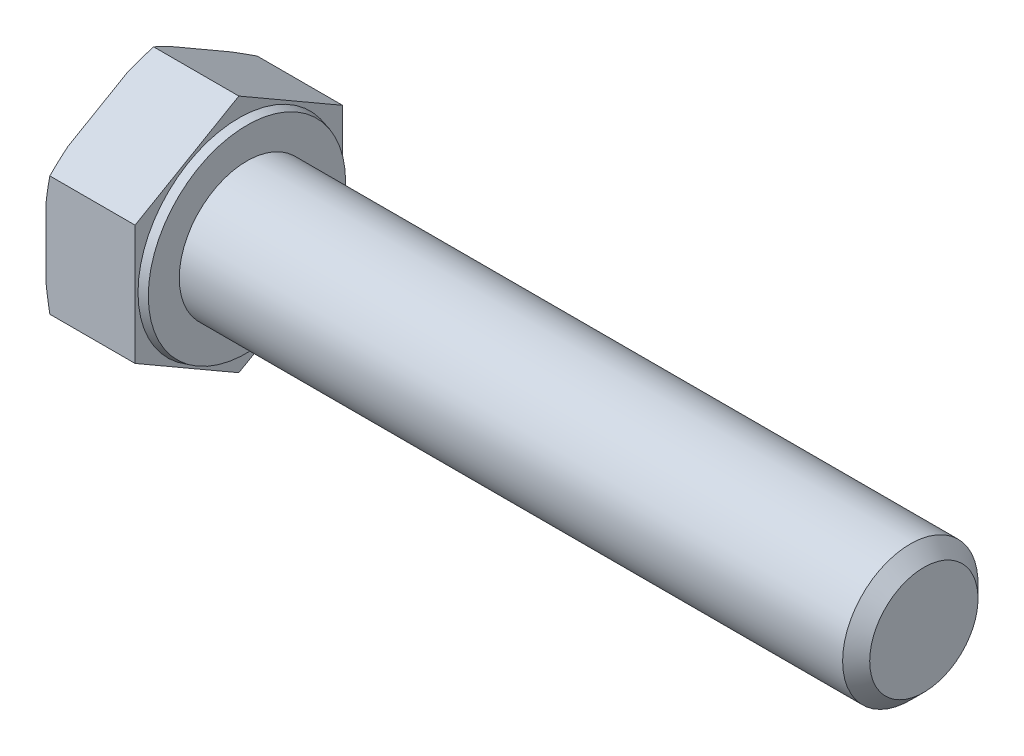
ISO-10303-21;
HEADER;
FILE_DESCRIPTION(('STEP AP214'),'2;1');
FILE_NAME('part.step','',(''),(''),'','','');
FILE_SCHEMA(('AUTOMOTIVE_DESIGN { 1 0 10303 214 1 1 1 1 }'));
ENDSEC;
DATA;
#1=APPLICATION_CONTEXT('core data for automotive mechanical design processes');
#2=APPLICATION_PROTOCOL_DEFINITION('international standard','automotive_design',2000,#1);
#3=PRODUCT_CONTEXT('',#1,'mechanical');
#4=PRODUCT('Part','Part','',(#3));
#5=PRODUCT_RELATED_PRODUCT_CATEGORY('part','',(#4));
#6=PRODUCT_DEFINITION_FORMATION('','',#4);
#7=PRODUCT_DEFINITION_CONTEXT('part definition',#1,'design');
#8=PRODUCT_DEFINITION('design','',#6,#7);
#9=PRODUCT_DEFINITION_SHAPE('','',#8);
#10=(LENGTH_UNIT() NAMED_UNIT(*) SI_UNIT(.MILLI.,.METRE.));
#11=(NAMED_UNIT(*) PLANE_ANGLE_UNIT() SI_UNIT($,.RADIAN.));
#12=(NAMED_UNIT(*) SI_UNIT($,.STERADIAN.) SOLID_ANGLE_UNIT());
#13=UNCERTAINTY_MEASURE_WITH_UNIT(LENGTH_MEASURE(1.E-05),#10,'distance_accuracy_value','');
#14=(GEOMETRIC_REPRESENTATION_CONTEXT(3) GLOBAL_UNCERTAINTY_ASSIGNED_CONTEXT((#13)) GLOBAL_UNIT_ASSIGNED_CONTEXT((#10,
#11,#12)) REPRESENTATION_CONTEXT('',''));
#15=CARTESIAN_POINT('',(0.,0.,0.));
#16=DIRECTION('',(0.,0.,1.));
#17=DIRECTION('',(1.,0.,0.));
#18=AXIS2_PLACEMENT_3D('',#15,#16,#17);
#19=CARTESIAN_POINT('',(50.6,-4.42500000000009,-7.66432482349223));
#20=DIRECTION('',(0.,-0.866025403784442,-0.499999999999995));
#21=DIRECTION('',(0.,0.499999999999995,-0.866025403784441));
#22=AXIS2_PLACEMENT_3D('',#19,#20,#21);
#23=PLANE('',#22);
#24=DIRECTION('',(-1.,0.,0.));
#25=VECTOR('',#24,1.);
#26=CARTESIAN_POINT('',(50.6,-8.85,0.));
#27=LINE('',#26,#25);
#28=CARTESIAN_POINT('',(0.,-8.85,0.));
#29=VERTEX_POINT('',#28);
#30=CARTESIAN_POINT('',(-6.29792306844368,-8.85,0.));
#31=VERTEX_POINT('',#30);
#32=EDGE_CURVE('E158',#29,#31,#27,.T.);
#33=ORIENTED_EDGE('',*,*,#32,.T.);
#34=CARTESIAN_POINT('',(-4.7699615006699,-11.9174022332107,5.3128965151713));
#35=CARTESIAN_POINT('',(-4.83614833570257,-11.8050473190038,5.11829209528478));
#36=CARTESIAN_POINT('',(-4.90167255003095,-11.6925948603644,4.92351872348535));
#37=CARTESIAN_POINT('',(-5.03118559698242,-11.4674663528304,4.53358471020429));
#38=CARTESIAN_POINT('',(-5.09517439305191,-11.3547902986816,4.33842405962226));
#39=CARTESIAN_POINT('',(-5.28456041407138,-11.0163157536771,3.75216895060564));
#40=CARTESIAN_POINT('',(-5.40733223857273,-10.7901468045143,3.3604328395613));
#41=CARTESIAN_POINT('',(-5.64480594732521,-10.3342684187143,2.57082831328319));
#42=CARTESIAN_POINT('',(-5.75941225873481,-10.1045464495324,2.17293819104533));
#43=CARTESIAN_POINT('',(-5.97591685440881,-9.6436033227612,1.37456127607789));
#44=CARTESIAN_POINT('',(-6.07781581130404,-9.41238224520544,0.974074621970503));
#45=CARTESIAN_POINT('',(-6.26134144326315,-8.95638364479248,0.184261877874949));
#46=CARTESIAN_POINT('',(-6.34355573274743,-8.73166601658844,-0.204960471530831));
#47=CARTESIAN_POINT('',(-6.48746045966098,-8.2805512783751,-0.986314118159494));
#48=CARTESIAN_POINT('',(-6.54915189984519,-8.05415425097466,-1.37844527229961));
#49=CARTESIAN_POINT('',(-6.62254434564547,-7.71410474496151,-1.9674282938031));
#50=CARTESIAN_POINT('',(-6.64378861584913,-7.60095958105454,-2.16340146632069));
#51=CARTESIAN_POINT('',(-6.67950592063896,-7.37440457175731,-2.55580625313272));
#52=CARTESIAN_POINT('',(-6.69397933196105,-7.26099474144627,-2.75223784130922));
#53=CARTESIAN_POINT('',(-6.7157765759338,-7.03401139991638,-3.14538452131075));
#54=CARTESIAN_POINT('',(-6.72310096885371,-6.92043790222291,-3.34209958970915));
#55=CARTESIAN_POINT('',(-6.73040192529392,-6.69323186195545,-3.73563199523894));
#56=CARTESIAN_POINT('',(-6.73037853713207,-6.57959931977464,-3.93244933168932));
#57=CARTESIAN_POINT('',(-6.72320871548941,-6.35929562962563,-4.31402651612232));
#58=CARTESIAN_POINT('',(-6.71649505277964,-6.25262090601261,-4.49879255730344));
#59=CARTESIAN_POINT('',(-6.69675463432834,-6.03941600442701,-4.86807427927243));
#60=CARTESIAN_POINT('',(-6.68372760236287,-5.93288583298343,-5.05258994875172));
#61=CARTESIAN_POINT('',(-6.63559663675346,-5.61363013252953,-5.60555704254388));
#62=CARTESIAN_POINT('',(-6.59144268713134,-5.40123548697151,-5.97343535990596));
#63=CARTESIAN_POINT('',(-6.48226269320506,-4.97681311893132,-6.70855646522027));
#64=CARTESIAN_POINT('',(-6.41713860156276,-4.7647919199632,-7.07578795411474));
#65=CARTESIAN_POINT('',(-6.27018625376656,-4.34222339340586,-7.80769811179158));
#66=CARTESIAN_POINT('',(-6.18835790112246,-4.1316760743376,-8.17237676581522));
#67=CARTESIAN_POINT('',(-6.00866271800198,-3.70472589760515,-8.91187616421634));
#68=CARTESIAN_POINT('',(-5.91033992742069,-3.48837165185492,-9.286612710289));
#69=CARTESIAN_POINT('',(-5.70311989656312,-3.05693413716248,-10.0338844060276));
#70=CARTESIAN_POINT('',(-5.59422212603359,-2.84185093252738,-10.4064194443103));
#71=CARTESIAN_POINT('',(-5.36943684134144,-2.41473283183158,-11.1462096955477));
#72=CARTESIAN_POINT('',(-5.25362330968472,-2.2026881429877,-11.5134818701005));
#73=CARTESIAN_POINT('',(-5.07537550670142,-1.88529185166037,-12.0632283728134));
#74=CARTESIAN_POINT('',(-5.01521325258259,-1.77961882394802,-12.2462594258008));
#75=CARTESIAN_POINT('',(-4.89354912869936,-1.56846779942573,-12.6119837283436));
#76=CARTESIAN_POINT('',(-4.83204728425027,-1.462989798971,-12.794676984212));
#77=CARTESIAN_POINT('',(-4.7699615006699,-1.35759776678936,-12.9772213386635));
#78=B_SPLINE_CURVE_WITH_KNOTS('',3,(#34,#35,#36,#37,#38,#39,#40,#41,#42,#43,#44,#45,#46,#47,#48,
#49,#50,#51,#52,#53,#54,#55,#56,#57,#58,#59,#60,#61,#62,#63,#64,#65,#66,#67,#68,#69,#70,#71,#72,
#73,#74,#75,#76,#77),.UNSPECIFIED.,.F.,.F.,(4,2,2,2,2,2,2,2,2,2,2,2,2,2,2,2,2,2,2,2,2,4),(0.,
0.70276173034238,1.40554017472233,2.81157217612387,4.23201032618944,5.6523732571052,
7.02270828812482,8.39297635416766,9.07474696516834,9.75647963740092,10.438158877887,
11.119833635759,11.7601005309412,12.4003954417532,13.6809617128842,14.9676044823533,
16.2542546841745,17.5852978857349,18.9164078632869,20.2352036230902,20.894426976119,
21.553637882061),.UNSPECIFIED.);
#79=CARTESIAN_POINT('',(-6.58000000000003,-7.90869530364146,-1.63038755949604));
#80=VERTEX_POINT('',#79);
#81=EDGE_CURVE('E203',#31,#80,#78,.T.);
#82=ORIENTED_EDGE('',*,*,#81,.T.);
#83=DIRECTION('',(0.,-0.499999999999995,0.866025403784442));
#84=VECTOR('',#83,1.);
#85=CARTESIAN_POINT('',(-6.58,-4.42500000000009,-7.66432482349223));
#86=LINE('',#85,#84);
#87=CARTESIAN_POINT('',(-6.58,-5.36630469635854,-6.03393726399618));
#88=VERTEX_POINT('',#87);
#89=EDGE_CURVE('E213',#88,#80,#86,.T.);
#90=ORIENTED_EDGE('',*,*,#89,.F.);
#91=CARTESIAN_POINT('',(-6.29792306844368,-4.42500000000009,-7.66432482349223));
#92=VERTEX_POINT('',#91);
#93=EDGE_CURVE('E216',#88,#92,#78,.T.);
#94=ORIENTED_EDGE('',*,*,#93,.T.);
#95=DIRECTION('',(-1.,0.,0.));
#96=VECTOR('',#95,1.);
#97=CARTESIAN_POINT('',(50.6,-4.42500000000009,-7.66432482349223));
#98=LINE('',#97,#96);
#99=CARTESIAN_POINT('',(0.,-4.42500000000009,-7.66432482349223));
#100=VERTEX_POINT('',#99);
#101=EDGE_CURVE('E169',#100,#92,#98,.T.);
#102=ORIENTED_EDGE('',*,*,#101,.F.);
#103=DIRECTION('',(0.,-0.499999999999995,0.866025403784441));
#104=VECTOR('',#103,1.);
#105=CARTESIAN_POINT('',(0.,-4.42500000000009,-7.66432482349223));
#106=LINE('',#105,#104);
#107=EDGE_CURVE('E184',#100,#29,#106,.T.);
#108=ORIENTED_EDGE('',*,*,#107,.T.);
#109=EDGE_LOOP('',(#33,#82,#90,#94,#102,#108));
#110=FACE_BOUND('',#109,.T.);
#111=ADVANCED_FACE('F36',(#110),#23,.T.);
#112=CARTESIAN_POINT('',(50.6,4.42499999999993,-7.66432482349232));
#113=DIRECTION('',(0.,0.,-1.));
#114=DIRECTION('',(0.,1.,0.));
#115=AXIS2_PLACEMENT_3D('',#112,#113,#114);
#116=PLANE('',#115);
#117=ORIENTED_EDGE('',*,*,#101,.T.);
#118=CARTESIAN_POINT('',(-5.00864005639831,-9.73789651517145,-7.66432482349217));
#119=CARTESIAN_POINT('',(-5.07003318744064,-9.52322769233334,-7.66432482349218));
#120=CARTESIAN_POINT('',(-5.13071664914256,-9.30835600664128,-7.66432482349218));
#121=CARTESIAN_POINT('',(-5.2504442425723,-8.87815277711283,-7.66432482349218));
#122=CARTESIAN_POINT('',(-5.30948834652955,-8.66282122555281,-7.66432482349219));
#123=CARTESIAN_POINT('',(-5.48387527888684,-8.01589307910885,-7.66432482349219));
#124=CARTESIAN_POINT('',(-5.59642298983084,-7.58353558067021,-7.6643248234922));
#125=CARTESIAN_POINT('',(-5.81266226723173,-6.71259000391773,-7.66432482349221));
#126=CARTESIAN_POINT('',(-5.91626806915323,-6.27398046842187,-7.66432482349221));
#127=CARTESIAN_POINT('',(-6.11029091280608,-5.39384656433909,-7.66432482349222));
#128=CARTESIAN_POINT('',(-6.20070892550878,-4.95232241284974,-7.66432482349222));
#129=CARTESIAN_POINT('',(-6.36160933963008,-4.08051166755351,-7.66432482349223));
#130=CARTESIAN_POINT('',(-6.43264625776086,-3.65032885049375,-7.66432482349224));
#131=CARTESIAN_POINT('',(-6.55428187483288,-2.78707107422335,-7.66432482349225));
#132=CARTESIAN_POINT('',(-6.60488453148917,-2.35399669158535,-7.66432482349225));
#133=CARTESIAN_POINT('',(-6.66240831794471,-1.70368188145931,-7.66432482349226));
#134=CARTESIAN_POINT('',(-6.67850532779577,-1.48723464984804,-7.66432482349226));
#135=CARTESIAN_POINT('',(-6.70429433272965,-1.05396299728827,-7.66432482349227));
#136=CARTESIAN_POINT('',(-6.71398664875919,-0.837138595786226,-7.66432482349227));
#137=CARTESIAN_POINT('',(-6.72672253024382,-0.403302294793051,-7.66432482349227));
#138=CARTESIAN_POINT('',(-6.72976638437883,-0.186290403852155,-7.66432482349227));
#139=CARTESIAN_POINT('',(-6.7291358967764,0.247718950123678,-7.66432482349228));
#140=CARTESIAN_POINT('',(-6.72546155695146,0.464716413162706,-7.66432482349228));
#141=CARTESIAN_POINT('',(-6.70624362970486,1.06036953223341,-7.66432482349229));
#142=CARTESIAN_POINT('',(-6.68388895075078,1.43882252598365,-7.66432482349229));
#143=CARTESIAN_POINT('',(-6.62050559151052,2.19412494594648,-7.6643248234923));
#144=CARTESIAN_POINT('',(-6.57947609181733,2.57097430106276,-7.6643248234923));
#145=CARTESIAN_POINT('',(-6.48113797206862,3.32388976987407,-7.66432482349231));
#146=CARTESIAN_POINT('',(-6.4237712185853,3.69994816672772,-7.66432482349232));
#147=CARTESIAN_POINT('',(-6.2956564145037,4.44978573942378,-7.66432482349232));
#148=CARTESIAN_POINT('',(-6.22490691200718,4.82356466341955,-7.66432482349233));
#149=CARTESIAN_POINT('',(-6.0704014797458,5.58003633732887,-7.66432482349234));
#150=CARTESIAN_POINT('',(-5.98632024183774,5.96266195818458,-7.66432482349234));
#151=CARTESIAN_POINT('',(-5.80919867667365,6.72583533235177,-7.66432482349235));
#152=CARTESIAN_POINT('',(-5.71615790531566,7.10638298167437,-7.66432482349235));
#153=CARTESIAN_POINT('',(-5.52374117974904,7.86297645537245,-7.66432482349236));
#154=CARTESIAN_POINT('',(-5.42441511026811,8.23903503370974,-7.66432482349236));
#155=CARTESIAN_POINT('',(-5.27134102225385,8.80195695976291,-7.66432482349237));
#156=CARTESIAN_POINT('',(-5.21964171692946,8.98938164843282,-7.66432482349237));
#157=CARTESIAN_POINT('',(-5.11502150400523,9.36388780999383,-7.66432482349237));
#158=CARTESIAN_POINT('',(-5.06210060924165,9.55096928646908,-7.66432482349238));
#159=CARTESIAN_POINT('',(-5.00864005639831,9.73789651517129,-7.66432482349238));
#160=B_SPLINE_CURVE_WITH_KNOTS('',3,(#118,#119,#120,#121,#122,#123,#124,#125,#126,#127,#128,
#129,#130,#131,#132,#133,#134,#135,#136,#137,#138,#139,#140,#141,#142,#143,#144,#145,#146,#147,
#148,#149,#150,#151,#152,#153,#154,#155,#156,#157,#158,#159),.UNSPECIFIED.,.F.,.F.,(4,2,2,2,2,2,
2,2,2,2,2,2,2,2,2,2,2,2,2,2,4),(0.,0.669823290546161,1.33965792092904,2.67986595636369,
4.03175825312792,5.38355096443301,6.69120700403605,7.99860965473741,8.64966414612008,
9.300686009923,9.95167960543101,10.6026730156168,11.7394565125237,12.876289893615,
14.0172201663474,15.1582742899967,16.3334026116279,17.5085892114817,18.6753990362947,
19.2586689197893,19.8419326771629),.UNSPECIFIED.);
#161=CARTESIAN_POINT('',(-6.58000000000003,-2.54239060728318,-7.66432482349217));
#162=VERTEX_POINT('',#161);
#163=EDGE_CURVE('E224',#92,#162,#160,.T.);
#164=ORIENTED_EDGE('',*,*,#163,.T.);
#165=DIRECTION('',(0.,-1.,0.));
#166=VECTOR('',#165,1.);
#167=CARTESIAN_POINT('',(-6.58,4.42499999999993,-7.66432482349232));
#168=LINE('',#167,#166);
#169=CARTESIAN_POINT('',(-6.58,2.54239060728305,-7.6643248234923));
#170=VERTEX_POINT('',#169);
#171=EDGE_CURVE('E164',#170,#162,#168,.T.);
#172=ORIENTED_EDGE('',*,*,#171,.F.);
#173=CARTESIAN_POINT('',(-6.29792306844368,4.42499999999993,-7.66432482349232));
#174=VERTEX_POINT('',#173);
#175=EDGE_CURVE('E51',#170,#174,#160,.T.);
#176=ORIENTED_EDGE('',*,*,#175,.T.);
#177=DIRECTION('',(-1.,0.,0.));
#178=VECTOR('',#177,1.);
#179=CARTESIAN_POINT('',(50.6,4.42499999999993,-7.66432482349232));
#180=LINE('',#179,#178);
#181=CARTESIAN_POINT('',(0.,4.42499999999993,-7.66432482349232));
#182=VERTEX_POINT('',#181);
#183=EDGE_CURVE('E155',#182,#174,#180,.T.);
#184=ORIENTED_EDGE('',*,*,#183,.F.);
#185=DIRECTION('',(0.,-1.,0.));
#186=VECTOR('',#185,1.);
#187=CARTESIAN_POINT('',(0.,8.84999999999992,-7.66432482349237));
#188=LINE('',#187,#186);
#189=EDGE_CURVE('E182',#182,#100,#188,.T.);
#190=ORIENTED_EDGE('',*,*,#189,.T.);
#191=EDGE_LOOP('',(#117,#164,#172,#176,#184,#190));
#192=FACE_BOUND('',#191,.T.);
#193=ADVANCED_FACE('F251',(#192),#116,.T.);
#194=CARTESIAN_POINT('',(50.6,8.85,0.));
#195=DIRECTION('',(0.,0.866025403784435,-0.500000000000007));
#196=DIRECTION('',(0.,0.500000000000007,0.866025403784435));
#197=AXIS2_PLACEMENT_3D('',#194,#195,#196);
#198=PLANE('',#197);
#199=ORIENTED_EDGE('',*,*,#183,.T.);
#200=CARTESIAN_POINT('',(-4.76996150066986,1.35759776678906,-12.9772213386637));
#201=CARTESIAN_POINT('',(-4.83614833570253,1.46995268099604,-12.7826169187772));
#202=CARTESIAN_POINT('',(-4.9016725500309,1.58240513963541,-12.5878435469777));
#203=CARTESIAN_POINT('',(-5.03118559698238,1.80753364716942,-12.1979095336967));
#204=CARTESIAN_POINT('',(-5.09517439305187,1.92020970131818,-12.0027488831146));
#205=CARTESIAN_POINT('',(-5.28456041407135,2.25868424632273,-11.416493774098));
#206=CARTESIAN_POINT('',(-5.40733223857269,2.48485319548548,-11.0247576630537));
#207=CARTESIAN_POINT('',(-5.64480594732517,2.94073158128551,-10.2351531367756));
#208=CARTESIAN_POINT('',(-5.75941225873478,3.17045355046743,-9.83726301453771));
#209=CARTESIAN_POINT('',(-5.97591685440879,3.63139667723867,-9.03888609957028));
#210=CARTESIAN_POINT('',(-6.07781581130402,3.86261775479443,-8.63839944546289));
#211=CARTESIAN_POINT('',(-6.26134144326313,4.3186163552074,-7.84858670136733));
#212=CARTESIAN_POINT('',(-6.34355573274742,4.54333398341145,-7.45936435196155));
#213=CARTESIAN_POINT('',(-6.48746045966097,4.99444872162482,-6.67801070533289));
#214=CARTESIAN_POINT('',(-6.54915189984519,5.22084574902526,-6.28587955119277));
#215=CARTESIAN_POINT('',(-6.62254434564547,5.56089525503842,-5.69689652968929));
#216=CARTESIAN_POINT('',(-6.64378861584913,5.6740404189454,-5.5009233571717));
#217=CARTESIAN_POINT('',(-6.67950592063896,5.90059542824263,-5.10851857035966));
#218=CARTESIAN_POINT('',(-6.69397933196106,6.01400525855368,-4.91208698218316));
#219=CARTESIAN_POINT('',(-6.7157765759338,6.24098860008357,-4.51894030218163));
#220=CARTESIAN_POINT('',(-6.72310096885372,6.35456209777704,-4.32222523378324));
#221=CARTESIAN_POINT('',(-6.73040192529394,6.58176813804451,-3.92869282825345));
#222=CARTESIAN_POINT('',(-6.73037853713208,6.69540068022533,-3.73187549180306));
#223=CARTESIAN_POINT('',(-6.72320871548943,6.91570437037435,-3.35029830737006));
#224=CARTESIAN_POINT('',(-6.71649505277966,7.02237909398738,-3.16553226618893));
#225=CARTESIAN_POINT('',(-6.69675463432836,7.23558399557298,-2.79625054421994));
#226=CARTESIAN_POINT('',(-6.68372760236289,7.34211416701656,-2.61173487474064));
#227=CARTESIAN_POINT('',(-6.63559663675348,7.66136986747048,-2.05876778094847));
#228=CARTESIAN_POINT('',(-6.59144268713136,7.87376451302852,-1.69088946358639));
#229=CARTESIAN_POINT('',(-6.48226269320508,8.29818688106872,-0.955768358272066));
#230=CARTESIAN_POINT('',(-6.41713860156277,8.51020808003686,-0.588536869377594));
#231=CARTESIAN_POINT('',(-6.27018625376657,8.93277660659422,0.143373288299261));
#232=CARTESIAN_POINT('',(-6.18835790112246,9.14332392566248,0.508051942322905));
#233=CARTESIAN_POINT('',(-6.00866271800198,9.57027410239495,1.24755134072404));
#234=CARTESIAN_POINT('',(-5.91033992742068,9.7866283481452,1.62228788679671));
#235=CARTESIAN_POINT('',(-5.7031198965631,10.2180658628377,2.36955958253527));
#236=CARTESIAN_POINT('',(-5.59422212603357,10.4331490674728,2.74209462081801));
#237=CARTESIAN_POINT('',(-5.36943684134141,10.8602671681686,3.48188487205548));
#238=CARTESIAN_POINT('',(-5.25362330968469,11.0723118570125,3.84915704660822));
#239=CARTESIAN_POINT('',(-5.07537550670138,11.3897081483398,4.39890354932111));
#240=CARTESIAN_POINT('',(-5.01521325258256,11.4953811760522,4.58193460230855));
#241=CARTESIAN_POINT('',(-4.89354912869932,11.7065322005745,4.94765890485139));
#242=CARTESIAN_POINT('',(-4.83204728425022,11.8120102010292,5.13035216071975));
#243=CARTESIAN_POINT('',(-4.76996150066986,11.9174022332109,5.3128965151713));
#244=B_SPLINE_CURVE_WITH_KNOTS('',3,(#200,#201,#202,#203,#204,#205,#206,#207,#208,#209,#210,
#211,#212,#213,#214,#215,#216,#217,#218,#219,#220,#221,#222,#223,#224,#225,#226,#227,#228,#229,
#230,#231,#232,#233,#234,#235,#236,#237,#238,#239,#240,#241,#242,#243),.UNSPECIFIED.,.F.,.F.,(4,
2,2,2,2,2,2,2,2,2,2,2,2,2,2,2,2,2,2,2,2,4),(0.,0.702761730342386,1.40554017472235,
2.8115721761239,4.23201032618948,5.65237325710526,7.02270828812488,8.39297635416775,
9.07474696516843,9.75647963740101,10.4381588778871,11.1198336357591,11.7601005309413,
12.4003954417533,13.6809617128843,14.9676044823535,16.2542546841748,17.5852978857351,
18.9164078632872,20.2352036230905,20.8944269761194,21.5536378820613),.UNSPECIFIED.);
#245=CARTESIAN_POINT('',(-6.58000000000003,5.36630469635833,-6.03393726399625));
#246=VERTEX_POINT('',#245);
#247=EDGE_CURVE('E246',#174,#246,#244,.T.);
#248=ORIENTED_EDGE('',*,*,#247,.T.);
#249=DIRECTION('',(0.,-0.500000000000007,-0.866025403784435));
#250=VECTOR('',#249,1.);
#251=CARTESIAN_POINT('',(-6.58,8.85,0.));
#252=LINE('',#251,#250);
#253=CARTESIAN_POINT('',(-6.58,7.90869530364155,-1.63038755949607));
#254=VERTEX_POINT('',#253);
#255=EDGE_CURVE('E236',#254,#246,#252,.T.);
#256=ORIENTED_EDGE('',*,*,#255,.F.);
#257=CARTESIAN_POINT('',(-6.29792306844368,8.85,0.));
#258=VERTEX_POINT('',#257);
#259=EDGE_CURVE('E59',#254,#258,#244,.T.);
#260=ORIENTED_EDGE('',*,*,#259,.T.);
#261=DIRECTION('',(-1.,0.,0.));
#262=VECTOR('',#261,1.);
#263=CARTESIAN_POINT('',(50.6,8.85,0.));
#264=LINE('',#263,#262);
#265=CARTESIAN_POINT('',(0.,8.85,0.));
#266=VERTEX_POINT('',#265);
#267=EDGE_CURVE('E152',#266,#258,#264,.T.);
#268=ORIENTED_EDGE('',*,*,#267,.F.);
#269=DIRECTION('',(0.,-0.500000000000007,-0.866025403784435));
#270=VECTOR('',#269,1.);
#271=CARTESIAN_POINT('',(0.,8.85000000000003,0.));
#272=LINE('',#271,#270);
#273=EDGE_CURVE('E180',#266,#182,#272,.T.);
#274=ORIENTED_EDGE('',*,*,#273,.T.);
#275=EDGE_LOOP('',(#199,#248,#256,#260,#268,#274));
#276=FACE_BOUND('',#275,.T.);
#277=ADVANCED_FACE('F244',(#276),#198,.T.);
#278=CARTESIAN_POINT('',(50.6,4.42500000000004,7.66432482349226));
#279=DIRECTION('',(0.,0.866025403784442,0.499999999999995));
#280=DIRECTION('',(0.,-0.499999999999995,0.866025403784441));
#281=AXIS2_PLACEMENT_3D('',#278,#279,#280);
#282=PLANE('',#281);
#283=ORIENTED_EDGE('',*,*,#267,.T.);
#284=CARTESIAN_POINT('',(-4.76996150066987,11.9174022332108,-5.31289651517143));
#285=CARTESIAN_POINT('',(-4.83614833570254,11.8050473190038,-5.1182920952849));
#286=CARTESIAN_POINT('',(-4.90167255003092,11.6925948603644,-4.92351872348547));
#287=CARTESIAN_POINT('',(-5.03118559698239,11.4674663528304,-4.53358471020441));
#288=CARTESIAN_POINT('',(-5.09517439305188,11.3547902986817,-4.33842405962238));
#289=CARTESIAN_POINT('',(-5.28456041407136,11.0163157536771,-3.75216895060575));
#290=CARTESIAN_POINT('',(-5.40733223857271,10.7901468045144,-3.36043283956141));
#291=CARTESIAN_POINT('',(-5.64480594732519,10.3342684187144,-2.57082831328329));
#292=CARTESIAN_POINT('',(-5.75941225873479,10.1045464495324,-2.17293819104543));
#293=CARTESIAN_POINT('',(-5.9759168544088,9.64360332276122,-1.374561276078));
#294=CARTESIAN_POINT('',(-6.07781581130403,9.41238224520547,-0.974074621970604));
#295=CARTESIAN_POINT('',(-6.26134144326314,8.9563836447925,-0.184261877875045));
#296=CARTESIAN_POINT('',(-6.34355573274742,8.73166601658846,0.204960471530737));
#297=CARTESIAN_POINT('',(-6.48746045966097,8.28055127837511,0.986314118159404));
#298=CARTESIAN_POINT('',(-6.54915189984519,8.05415425097467,1.37844527229953));
#299=CARTESIAN_POINT('',(-6.62254434564547,7.71410474496152,1.96742829380301));
#300=CARTESIAN_POINT('',(-6.64378861584914,7.60095958105455,2.1634014663206));
#301=CARTESIAN_POINT('',(-6.67950592063896,7.37440457175733,2.55580625313264));
#302=CARTESIAN_POINT('',(-6.69397933196106,7.26099474144628,2.75223784130914));
#303=CARTESIAN_POINT('',(-6.7157765759338,7.03401139991639,3.14538452131068));
#304=CARTESIAN_POINT('',(-6.72310096885372,6.92043790222292,3.34209958970907));
#305=CARTESIAN_POINT('',(-6.73040192529394,6.69323186195546,3.73563199523886));
#306=CARTESIAN_POINT('',(-6.73037853713208,6.57959931977464,3.93244933168925));
#307=CARTESIAN_POINT('',(-6.72320871548943,6.35929562962563,4.31402651612225));
#308=CARTESIAN_POINT('',(-6.71649505277966,6.25262090601261,4.49879255730338));
#309=CARTESIAN_POINT('',(-6.69675463432836,6.03941600442701,4.86807427927237));
#310=CARTESIAN_POINT('',(-6.68372760236289,5.93288583298343,5.05258994875167));
#311=CARTESIAN_POINT('',(-6.63559663675348,5.61363013252952,5.60555704254384));
#312=CARTESIAN_POINT('',(-6.59144268713136,5.40123548697149,5.97343535990593));
#313=CARTESIAN_POINT('',(-6.48226269320508,4.9768131189313,6.70855646522025));
#314=CARTESIAN_POINT('',(-6.41713860156277,4.76479191996317,7.07578795411472));
#315=CARTESIAN_POINT('',(-6.27018625376657,4.34222339340582,7.80769811179158));
#316=CARTESIAN_POINT('',(-6.18835790112247,4.13167607433756,8.17237676581522));
#317=CARTESIAN_POINT('',(-6.00866271800198,3.70472589760511,8.91187616421636));
#318=CARTESIAN_POINT('',(-5.91033992742068,3.48837165185487,9.28661271028903));
#319=CARTESIAN_POINT('',(-5.70311989656311,3.05693413716242,10.0338844060276));
#320=CARTESIAN_POINT('',(-5.59422212603358,2.84185093252732,10.4064194443103));
#321=CARTESIAN_POINT('',(-5.36943684134142,2.41473283183151,11.1462096955478));
#322=CARTESIAN_POINT('',(-5.2536233096847,2.20268814298763,11.5134818701005));
#323=CARTESIAN_POINT('',(-5.07537550670139,1.88529185166029,12.0632283728134));
#324=CARTESIAN_POINT('',(-5.01521325258257,1.77961882394793,12.2462594258009));
#325=CARTESIAN_POINT('',(-4.89354912869933,1.56846779942564,12.6119837283437));
#326=CARTESIAN_POINT('',(-4.83204728425023,1.46298979897091,12.7946769842121));
#327=CARTESIAN_POINT('',(-4.76996150066987,1.35759776678926,12.9772213386636));
#328=B_SPLINE_CURVE_WITH_KNOTS('',3,(#284,#285,#286,#287,#288,#289,#290,#291,#292,#293,#294,
#295,#296,#297,#298,#299,#300,#301,#302,#303,#304,#305,#306,#307,#308,#309,#310,#311,#312,#313,
#314,#315,#316,#317,#318,#319,#320,#321,#322,#323,#324,#325,#326,#327),.UNSPECIFIED.,.F.,.F.,(4,
2,2,2,2,2,2,2,2,2,2,2,2,2,2,2,2,2,2,2,2,4),(0.,0.702761730342384,1.40554017472234,
2.81157217612389,4.23201032618947,5.65237325710524,7.02270828812486,8.39297635416772,
9.07474696516839,9.75647963740098,10.4381588778871,11.119833635759,11.7601005309412,
12.4003954417533,13.6809617128843,14.9676044823535,16.2542546841747,17.5852978857351,
18.9164078632871,20.2352036230904,20.8944269761193,21.5536378820613),.UNSPECIFIED.);
#329=CARTESIAN_POINT('',(-6.58000000000003,7.90869530364148,1.63038755949594));
#330=VERTEX_POINT('',#329);
#331=EDGE_CURVE('E146',#258,#330,#328,.T.);
#332=ORIENTED_EDGE('',*,*,#331,.T.);
#333=DIRECTION('',(0.,0.499999999999995,-0.866025403784442));
#334=VECTOR('',#333,1.);
#335=CARTESIAN_POINT('',(-6.58,4.42500000000004,7.66432482349226));
#336=LINE('',#335,#334);
#337=CARTESIAN_POINT('',(-6.58,5.36630469635847,6.03393726399624));
#338=VERTEX_POINT('',#337);
#339=EDGE_CURVE('E145',#338,#330,#336,.T.);
#340=ORIENTED_EDGE('',*,*,#339,.F.);
#341=CARTESIAN_POINT('',(-6.29792306844368,4.42500000000004,7.66432482349226));
#342=VERTEX_POINT('',#341);
#343=EDGE_CURVE('E127',#338,#342,#328,.T.);
#344=ORIENTED_EDGE('',*,*,#343,.T.);
#345=DIRECTION('',(-1.,0.,0.));
#346=VECTOR('',#345,1.);
#347=CARTESIAN_POINT('',(50.6,4.42500000000004,7.66432482349226));
#348=LINE('',#347,#346);
#349=CARTESIAN_POINT('',(0.,4.42500000000004,7.66432482349226));
#350=VERTEX_POINT('',#349);
#351=EDGE_CURVE('E141',#350,#342,#348,.T.);
#352=ORIENTED_EDGE('',*,*,#351,.F.);
#353=DIRECTION('',(0.,0.499999999999995,-0.866025403784441));
#354=VECTOR('',#353,1.);
#355=CARTESIAN_POINT('',(0.,8.84999999999997,0.));
#356=LINE('',#355,#354);
#357=EDGE_CURVE('E178',#350,#266,#356,.T.);
#358=ORIENTED_EDGE('',*,*,#357,.T.);
#359=EDGE_LOOP('',(#283,#332,#340,#344,#352,#358));
#360=FACE_BOUND('',#359,.T.);
#361=ADVANCED_FACE('F140',(#360),#282,.T.);
#362=CARTESIAN_POINT('',(50.6,-4.42499999999998,7.66432482349229));
#363=DIRECTION('',(0.,0.,1.));
#364=DIRECTION('',(0.,-1.,0.));
#365=AXIS2_PLACEMENT_3D('',#362,#363,#364);
#366=PLANE('',#365);
#367=ORIENTED_EDGE('',*,*,#351,.T.);
#368=CARTESIAN_POINT('',(-5.00864005639831,9.7378965151714,7.66432482349224));
#369=CARTESIAN_POINT('',(-5.07003318744064,9.52322769233328,7.66432482349224));
#370=CARTESIAN_POINT('',(-5.13071664914256,9.30835600664122,7.66432482349224));
#371=CARTESIAN_POINT('',(-5.2504442425723,8.87815277711278,7.66432482349225));
#372=CARTESIAN_POINT('',(-5.30948834652955,8.66282122555276,7.66432482349225));
#373=CARTESIAN_POINT('',(-5.48387527888684,8.0158930791088,7.66432482349225));
#374=CARTESIAN_POINT('',(-5.59642298983084,7.58353558067016,7.66432482349225));
#375=CARTESIAN_POINT('',(-5.81266226723173,6.71259000391768,7.66432482349225));
#376=CARTESIAN_POINT('',(-5.91626806915323,6.27398046842182,7.66432482349225));
#377=CARTESIAN_POINT('',(-6.11029091280608,5.39384656433903,7.66432482349226));
#378=CARTESIAN_POINT('',(-6.20070892550878,4.95232241284969,7.66432482349226));
#379=CARTESIAN_POINT('',(-6.36160933963008,4.08051166755345,7.66432482349226));
#380=CARTESIAN_POINT('',(-6.43264625776087,3.6503288504937,7.66432482349226));
#381=CARTESIAN_POINT('',(-6.55428187483288,2.7870710742233,7.66432482349227));
#382=CARTESIAN_POINT('',(-6.60488453148917,2.3539966915853,7.66432482349227));
#383=CARTESIAN_POINT('',(-6.66240831794471,1.70368188145926,7.66432482349227));
#384=CARTESIAN_POINT('',(-6.67850532779577,1.48723464984798,7.66432482349227));
#385=CARTESIAN_POINT('',(-6.70429433272965,1.05396299728821,7.66432482349227));
#386=CARTESIAN_POINT('',(-6.71398664875919,0.83713859578617,7.66432482349227));
#387=CARTESIAN_POINT('',(-6.72672253024382,0.403302294792995,7.66432482349227));
#388=CARTESIAN_POINT('',(-6.72976638437883,0.1862904038521,7.66432482349228));
#389=CARTESIAN_POINT('',(-6.7291358967764,-0.247718950123733,7.66432482349228));
#390=CARTESIAN_POINT('',(-6.72546155695146,-0.46471641316276,7.66432482349228));
#391=CARTESIAN_POINT('',(-6.70624362970486,-1.06036953223346,7.66432482349228));
#392=CARTESIAN_POINT('',(-6.68388895075078,-1.43882252598371,7.66432482349228));
#393=CARTESIAN_POINT('',(-6.62050559151052,-2.19412494594653,7.66432482349228));
#394=CARTESIAN_POINT('',(-6.57947609181733,-2.57097430106281,7.66432482349229));
#395=CARTESIAN_POINT('',(-6.48113797206862,-3.32388976987413,7.66432482349229));
#396=CARTESIAN_POINT('',(-6.4237712185853,-3.69994816672777,7.66432482349229));
#397=CARTESIAN_POINT('',(-6.2956564145037,-4.44978573942384,7.66432482349229));
#398=CARTESIAN_POINT('',(-6.22490691200718,-4.8235646634196,7.66432482349229));
#399=CARTESIAN_POINT('',(-6.0704014797458,-5.58003633732892,7.6643248234923));
#400=CARTESIAN_POINT('',(-5.98632024183774,-5.96266195818463,7.6643248234923));
#401=CARTESIAN_POINT('',(-5.80919867667365,-6.72583533235183,7.6643248234923));
#402=CARTESIAN_POINT('',(-5.71615790531566,-7.10638298167442,7.6643248234923));
#403=CARTESIAN_POINT('',(-5.52374117974904,-7.8629764553725,7.66432482349231));
#404=CARTESIAN_POINT('',(-5.42441511026811,-8.2390350337098,7.66432482349231));
#405=CARTESIAN_POINT('',(-5.27134102225385,-8.80195695976297,7.66432482349231));
#406=CARTESIAN_POINT('',(-5.21964171692946,-8.98938164843288,7.66432482349231));
#407=CARTESIAN_POINT('',(-5.11502150400523,-9.36388780999389,7.66432482349231));
#408=CARTESIAN_POINT('',(-5.06210060924165,-9.55096928646914,7.66432482349231));
#409=CARTESIAN_POINT('',(-5.00864005639831,-9.73789651517135,7.66432482349231));
#410=B_SPLINE_CURVE_WITH_KNOTS('',3,(#368,#369,#370,#371,#372,#373,#374,#375,#376,#377,#378,
#379,#380,#381,#382,#383,#384,#385,#386,#387,#388,#389,#390,#391,#392,#393,#394,#395,#396,#397,
#398,#399,#400,#401,#402,#403,#404,#405,#406,#407,#408,#409),.UNSPECIFIED.,.F.,.F.,(4,2,2,2,2,2,
2,2,2,2,2,2,2,2,2,2,2,2,2,2,4),(0.,0.669823290546161,1.33965792092904,2.67986595636369,
4.03175825312792,5.38355096443301,6.69120700403605,7.99860965473742,8.64966414612009,
9.300686009923,9.95167960543102,10.6026730156168,11.7394565125237,12.876289893615,
14.0172201663474,15.1582742899967,16.3334026116279,17.5085892114817,18.6753990362947,
19.2586689197893,19.8419326771629),.UNSPECIFIED.);
#411=CARTESIAN_POINT('',(-6.58000000000003,2.54239060728313,7.66432482349219));
#412=VERTEX_POINT('',#411);
#413=EDGE_CURVE('E124',#342,#412,#410,.T.);
#414=ORIENTED_EDGE('',*,*,#413,.T.);
#415=DIRECTION('',(0.,1.,0.));
#416=VECTOR('',#415,1.);
#417=CARTESIAN_POINT('',(-6.58,-4.42499999999998,7.66432482349229));
#418=LINE('',#417,#416);
#419=CARTESIAN_POINT('',(-6.58,-2.5423906072831,7.66432482349229));
#420=VERTEX_POINT('',#419);
#421=EDGE_CURVE('E222',#420,#412,#418,.T.);
#422=ORIENTED_EDGE('',*,*,#421,.F.);
#423=CARTESIAN_POINT('',(-6.29792306844368,-4.42499999999998,7.66432482349229));
#424=VERTEX_POINT('',#423);
#425=EDGE_CURVE('E134',#420,#424,#410,.T.);
#426=ORIENTED_EDGE('',*,*,#425,.T.);
#427=DIRECTION('',(-1.,0.,0.));
#428=VECTOR('',#427,1.);
#429=CARTESIAN_POINT('',(50.6,-4.42499999999998,7.66432482349229));
#430=LINE('',#429,#428);
#431=CARTESIAN_POINT('',(0.,-4.42499999999998,7.66432482349229));
#432=VERTEX_POINT('',#431);
#433=EDGE_CURVE('E153',#432,#424,#430,.T.);
#434=ORIENTED_EDGE('',*,*,#433,.F.);
#435=DIRECTION('',(0.,1.,0.));
#436=VECTOR('',#435,1.);
#437=CARTESIAN_POINT('',(0.,8.85000000000003,7.66432482349225));
#438=LINE('',#437,#436);
#439=EDGE_CURVE('E151',#432,#350,#438,.T.);
#440=ORIENTED_EDGE('',*,*,#439,.T.);
#441=EDGE_LOOP('',(#367,#414,#422,#426,#434,#440));
#442=FACE_BOUND('',#441,.T.);
#443=ADVANCED_FACE('F148',(#442),#366,.T.);
#444=CARTESIAN_POINT('',(50.6,-8.85,0.));
#445=DIRECTION('',(0.,-0.866025403784438,0.500000000000001));
#446=DIRECTION('',(0.,-0.500000000000001,-0.866025403784438));
#447=AXIS2_PLACEMENT_3D('',#444,#445,#446);
#448=PLANE('',#447);
#449=ORIENTED_EDGE('',*,*,#433,.T.);
#450=CARTESIAN_POINT('',(-4.76996150066987,-1.35759776678916,12.9772213386637));
#451=CARTESIAN_POINT('',(-4.83614833570253,-1.46995268099614,12.7826169187771));
#452=CARTESIAN_POINT('',(-4.90167255003091,-1.58240513963551,12.5878435469777));
#453=CARTESIAN_POINT('',(-5.03118559698239,-1.80753364716952,12.1979095336966));
#454=CARTESIAN_POINT('',(-5.09517439305187,-1.92020970131828,12.0027488831146));
#455=CARTESIAN_POINT('',(-5.28456041407135,-2.25868424632282,11.416493774098));
#456=CARTESIAN_POINT('',(-5.4073322385727,-2.48485319548557,11.0247576630537));
#457=CARTESIAN_POINT('',(-5.64480594732518,-2.94073158128559,10.2351531367755));
#458=CARTESIAN_POINT('',(-5.75941225873479,-3.17045355046751,9.83726301453767));
#459=CARTESIAN_POINT('',(-5.97591685440879,-3.63139667723874,9.03888609957024));
#460=CARTESIAN_POINT('',(-6.07781581130402,-3.8626177547945,8.63839944546285));
#461=CARTESIAN_POINT('',(-6.26134144326314,-4.31861635520747,7.84858670136729));
#462=CARTESIAN_POINT('',(-6.34355573274742,-4.54333398341151,7.45936435196151));
#463=CARTESIAN_POINT('',(-6.48746045966097,-4.99444872162487,6.67801070533285));
#464=CARTESIAN_POINT('',(-6.54915189984519,-5.22084574902531,6.28587955119273));
#465=CARTESIAN_POINT('',(-6.62254434564547,-5.56089525503846,5.69689652968924));
#466=CARTESIAN_POINT('',(-6.64378861584913,-5.67404041894544,5.50092335717165));
#467=CARTESIAN_POINT('',(-6.67950592063896,-5.90059542824267,5.10851857035961));
#468=CARTESIAN_POINT('',(-6.69397933196106,-6.01400525855371,4.91208698218312));
#469=CARTESIAN_POINT('',(-6.7157765759338,-6.24098860008361,4.51894030218158));
#470=CARTESIAN_POINT('',(-6.72310096885372,-6.35456209777708,4.32222523378319));
#471=CARTESIAN_POINT('',(-6.73040192529394,-6.58176813804454,3.92869282825339));
#472=CARTESIAN_POINT('',(-6.73037853713208,-6.69540068022536,3.73187549180301));
#473=CARTESIAN_POINT('',(-6.72320871548943,-6.91570437037438,3.35029830737001));
#474=CARTESIAN_POINT('',(-6.71649505277966,-7.0223790939874,3.16553226618888));
#475=CARTESIAN_POINT('',(-6.69675463432836,-7.235583995573,2.79625054421989));
#476=CARTESIAN_POINT('',(-6.68372760236289,-7.34211416701658,2.61173487474059));
#477=CARTESIAN_POINT('',(-6.63559663675348,-7.6613698674705,2.05876778094842));
#478=CARTESIAN_POINT('',(-6.59144268713136,-7.87376451302853,1.69088946358633));
#479=CARTESIAN_POINT('',(-6.48226269320508,-8.29818688106872,0.955768358272013));
#480=CARTESIAN_POINT('',(-6.41713860156277,-8.51020808003686,0.58853686937754));
#481=CARTESIAN_POINT('',(-6.27018625376657,-8.93277660659421,-0.143373288299316));
#482=CARTESIAN_POINT('',(-6.18835790112247,-9.14332392566247,-0.508051942322961));
#483=CARTESIAN_POINT('',(-6.00866271800198,-9.57027410239494,-1.2475513407241));
#484=CARTESIAN_POINT('',(-5.91033992742068,-9.78662834814518,-1.62228788679676));
#485=CARTESIAN_POINT('',(-5.70311989656311,-10.2180658628376,-2.36955958253533));
#486=CARTESIAN_POINT('',(-5.59422212603357,-10.4331490674727,-2.74209462081807));
#487=CARTESIAN_POINT('',(-5.36943684134142,-10.8602671681686,-3.48188487205554));
#488=CARTESIAN_POINT('',(-5.25362330968469,-11.0723118570124,-3.84915704660829));
#489=CARTESIAN_POINT('',(-5.07537550670139,-11.3897081483398,-4.39890354932117));
#490=CARTESIAN_POINT('',(-5.01521325258256,-11.4953811760521,-4.58193460230861));
#491=CARTESIAN_POINT('',(-4.89354912869932,-11.7065322005744,-4.94765890485144));
#492=CARTESIAN_POINT('',(-4.83204728425023,-11.8120102010292,-5.13035216071981));
#493=CARTESIAN_POINT('',(-4.76996150066987,-11.9174022332108,-5.31289651517136));
#494=B_SPLINE_CURVE_WITH_KNOTS('',3,(#450,#451,#452,#453,#454,#455,#456,#457,#458,#459,#460,
#461,#462,#463,#464,#465,#466,#467,#468,#469,#470,#471,#472,#473,#474,#475,#476,#477,#478,#479,
#480,#481,#482,#483,#484,#485,#486,#487,#488,#489,#490,#491,#492,#493),.UNSPECIFIED.,.F.,.F.,(4,
2,2,2,2,2,2,2,2,2,2,2,2,2,2,2,2,2,2,2,2,4),(0.,0.702761730342388,1.40554017472235,
2.81157217612389,4.23201032618948,5.65237325710525,7.02270828812487,8.39297635416773,
9.07474696516841,9.75647963740099,10.4381588778871,11.1198336357591,11.7601005309413,
12.4003954417533,13.6809617128843,14.9676044823535,16.2542546841747,17.5852978857351,
18.9164078632871,20.2352036230904,20.8944269761193,21.5536378820613),.UNSPECIFIED.);
#495=CARTESIAN_POINT('',(-6.58000000000003,-5.36630469635837,6.03393726399621));
#496=VERTEX_POINT('',#495);
#497=EDGE_CURVE('E214',#424,#496,#494,.T.);
#498=ORIENTED_EDGE('',*,*,#497,.T.);
#499=DIRECTION('',(0.,0.500000000000001,0.866025403784438));
#500=VECTOR('',#499,1.);
#501=CARTESIAN_POINT('',(-6.58,-8.85,0.));
#502=LINE('',#501,#500);
#503=CARTESIAN_POINT('',(-6.58,-7.90869530364156,1.63038755949602));
#504=VERTEX_POINT('',#503);
#505=EDGE_CURVE('E220',#504,#496,#502,.T.);
#506=ORIENTED_EDGE('',*,*,#505,.F.);
#507=EDGE_CURVE('E205',#504,#31,#494,.T.);
#508=ORIENTED_EDGE('',*,*,#507,.T.);
#509=ORIENTED_EDGE('',*,*,#32,.F.);
#510=DIRECTION('',(0.,0.500000000000001,0.866025403784438));
#511=VECTOR('',#510,1.);
#512=CARTESIAN_POINT('',(0.,-4.42499999999999,7.66432482349229));
#513=LINE('',#512,#511);
#514=EDGE_CURVE('E175',#29,#432,#513,.T.);
#515=ORIENTED_EDGE('',*,*,#514,.T.);
#516=EDGE_LOOP('',(#449,#498,#506,#508,#509,#515));
#517=FACE_BOUND('',#516,.T.);
#518=ADVANCED_FACE('F272',(#517),#448,.T.);
#519=CARTESIAN_POINT('',(-6.58,0.,0.));
#520=DIRECTION('',(1.,0.,0.));
#521=DIRECTION('',(0.,0.,-1.));
#522=AXIS2_PLACEMENT_3D('',#519,#520,#521);
#523=PLANE('',#522);
#524=CARTESIAN_POINT('',(-6.58,0.,0.));
#525=DIRECTION('',(1.,0.,0.));
#526=DIRECTION('',(0.,0.,-1.));
#527=AXIS2_PLACEMENT_3D('',#524,#525,#526);
#528=CIRCLE('',#527,8.07500000000009);
#529=EDGE_CURVE('E189',#170,#246,#528,.T.);
#530=ORIENTED_EDGE('',*,*,#529,.F.);
#531=ORIENTED_EDGE('',*,*,#171,.T.);
#532=EDGE_CURVE('E187',#88,#162,#528,.T.);
#533=ORIENTED_EDGE('',*,*,#532,.F.);
#534=ORIENTED_EDGE('',*,*,#89,.T.);
#535=EDGE_CURVE('E188',#504,#80,#528,.T.);
#536=ORIENTED_EDGE('',*,*,#535,.F.);
#537=ORIENTED_EDGE('',*,*,#505,.T.);
#538=EDGE_CURVE('E195',#420,#496,#528,.T.);
#539=ORIENTED_EDGE('',*,*,#538,.F.);
#540=ORIENTED_EDGE('',*,*,#421,.T.);
#541=CARTESIAN_POINT('',(-6.58000000000003,0.,0.));
#542=DIRECTION('',(-1.,0.,0.));
#543=DIRECTION('',(0.,0.,1.));
#544=AXIS2_PLACEMENT_3D('',#541,#542,#543);
#545=CIRCLE('',#544,8.075);
#546=EDGE_CURVE('E129',#412,#338,#545,.T.);
#547=ORIENTED_EDGE('',*,*,#546,.T.);
#548=ORIENTED_EDGE('',*,*,#339,.T.);
#549=EDGE_CURVE('E193',#254,#330,#528,.T.);
#550=ORIENTED_EDGE('',*,*,#549,.F.);
#551=ORIENTED_EDGE('',*,*,#255,.T.);
#552=EDGE_LOOP('',(#530,#531,#533,#534,#536,#537,#539,#540,#547,#548,#550,#551));
#553=FACE_BOUND('',#552,.T.);
#554=ADVANCED_FACE('F218',(#553),#523,.F.);
#555=CARTESIAN_POINT('',(0.,8.85,0.));
#556=DIRECTION('',(-1.,0.,0.));
#557=DIRECTION('',(0.,0.,1.));
#558=AXIS2_PLACEMENT_3D('',#555,#556,#557);
#559=PLANE('',#558);
#560=CARTESIAN_POINT('',(0.,0.,0.));
#561=DIRECTION('',(-1.,0.,0.));
#562=DIRECTION('',(0.,0.,1.));
#563=AXIS2_PLACEMENT_3D('',#560,#561,#562);
#564=CIRCLE('',#563,7.44897459621555);
#565=CARTESIAN_POINT('',(0.,0.,7.44897459621555));
#566=VERTEX_POINT('',#565);
#567=EDGE_CURVE('E172',#566,#566,#564,.T.);
#568=ORIENTED_EDGE('',*,*,#567,.T.);
#569=EDGE_LOOP('',(#568));
#570=FACE_BOUND('',#569,.T.);
#571=ORIENTED_EDGE('',*,*,#107,.F.);
#572=ORIENTED_EDGE('',*,*,#189,.F.);
#573=ORIENTED_EDGE('',*,*,#273,.F.);
#574=ORIENTED_EDGE('',*,*,#357,.F.);
#575=ORIENTED_EDGE('',*,*,#439,.F.);
#576=ORIENTED_EDGE('',*,*,#514,.F.);
#577=EDGE_LOOP('',(#571,#572,#573,#574,#575,#576));
#578=FACE_BOUND('',#577,.T.);
#579=ADVANCED_FACE('F256',(#570,#578),#559,.F.);
#580=CARTESIAN_POINT('',(0.599999999999934,0.,0.));
#581=DIRECTION('',(-1.,0.,0.));
#582=DIRECTION('',(0.,0.,1.));
#583=AXIS2_PLACEMENT_3D('',#580,#581,#582);
#584=CONICAL_SURFACE('',#583,7.28820508075687,0.261799387799175);
#585=ORIENTED_EDGE('',*,*,#567,.F.);
#586=EDGE_LOOP('',(#585));
#587=FACE_BOUND('',#586,.T.);
#588=CARTESIAN_POINT('',(0.599999999999934,0.,0.));
#589=DIRECTION('',(-1.,0.,0.));
#590=DIRECTION('',(0.,0.,1.));
#591=AXIS2_PLACEMENT_3D('',#588,#589,#590);
#592=CIRCLE('',#591,7.28820508075687);
#593=CARTESIAN_POINT('',(0.599999999999934,0.,7.28820508075687));
#594=VERTEX_POINT('',#593);
#595=EDGE_CURVE('E168',#594,#594,#592,.T.);
#596=ORIENTED_EDGE('',*,*,#595,.T.);
#597=EDGE_LOOP('',(#596));
#598=FACE_BOUND('',#597,.T.);
#599=ADVANCED_FACE('F325',(#587,#598),#584,.T.);
#600=CARTESIAN_POINT('',(0.6,7.28820508075687,0.));
#601=DIRECTION('',(-1.,0.,0.));
#602=DIRECTION('',(0.,0.,1.));
#603=AXIS2_PLACEMENT_3D('',#600,#601,#602);
#604=PLANE('',#603);
#605=ORIENTED_EDGE('',*,*,#595,.F.);
#606=EDGE_LOOP('',(#605));
#607=FACE_BOUND('',#606,.T.);
#608=CARTESIAN_POINT('',(0.599999999999934,0.,0.));
#609=DIRECTION('',(-1.,0.,0.));
#610=DIRECTION('',(0.,0.,1.));
#611=AXIS2_PLACEMENT_3D('',#608,#609,#610);
#612=CIRCLE('',#611,5.);
#613=CARTESIAN_POINT('',(0.599999999999934,0.,5.));
#614=VERTEX_POINT('',#613);
#615=EDGE_CURVE('E165',#614,#614,#612,.T.);
#616=ORIENTED_EDGE('',*,*,#615,.T.);
#617=EDGE_LOOP('',(#616));
#618=FACE_BOUND('',#617,.T.);
#619=ADVANCED_FACE('F322',(#607,#618),#604,.F.);
#620=CARTESIAN_POINT('',(-1000.,0.,0.));
#621=DIRECTION('',(-1.,0.,0.));
#622=DIRECTION('',(0.,0.,1.));
#623=AXIS2_PLACEMENT_3D('',#620,#621,#622);
#624=CYLINDRICAL_SURFACE('',#623,5.);
#625=CARTESIAN_POINT('',(49.6000000000001,0.,0.));
#626=DIRECTION('',(-1.,0.,0.));
#627=DIRECTION('',(0.,0.,1.));
#628=AXIS2_PLACEMENT_3D('',#625,#626,#627);
#629=CIRCLE('',#628,5.);
#630=CARTESIAN_POINT('',(49.6000000000001,0.,5.));
#631=VERTEX_POINT('',#630);
#632=EDGE_CURVE('E44',#631,#631,#629,.T.);
#633=ORIENTED_EDGE('',*,*,#632,.T.);
#634=EDGE_LOOP('',(#633));
#635=FACE_BOUND('',#634,.T.);
#636=ORIENTED_EDGE('',*,*,#615,.F.);
#637=EDGE_LOOP('',(#636));
#638=FACE_BOUND('',#637,.T.);
#639=ADVANCED_FACE('F318',(#635,#638),#624,.T.);
#640=CARTESIAN_POINT('',(50.6,5.,0.));
#641=DIRECTION('',(-1.,0.,0.));
#642=DIRECTION('',(0.,0.,1.));
#643=AXIS2_PLACEMENT_3D('',#640,#641,#642);
#644=PLANE('',#643);
#645=CARTESIAN_POINT('',(50.6,0.,0.));
#646=DIRECTION('',(-1.,0.,0.));
#647=DIRECTION('',(0.,0.,1.));
#648=AXIS2_PLACEMENT_3D('',#645,#646,#647);
#649=CIRCLE('',#648,4.);
#650=CARTESIAN_POINT('',(50.6,0.,4.));
#651=VERTEX_POINT('',#650);
#652=EDGE_CURVE('E12',#651,#651,#649,.F.);
#653=ORIENTED_EDGE('',*,*,#652,.T.);
#654=EDGE_LOOP('',(#653));
#655=FACE_BOUND('',#654,.T.);
#656=ADVANCED_FACE('F315',(#655),#644,.F.);
#657=CARTESIAN_POINT('',(-6.58000000000003,0.,0.));
#658=DIRECTION('',(1.,0.,0.));
#659=DIRECTION('',(0.,0.,-1.));
#660=AXIS2_PLACEMENT_3D('',#657,#658,#659);
#661=CONICAL_SURFACE('',#660,8.075,1.22173047639598);
#662=ORIENTED_EDGE('',*,*,#532,.T.);
#663=ORIENTED_EDGE('',*,*,#163,.F.);
#664=ORIENTED_EDGE('',*,*,#93,.F.);
#665=EDGE_LOOP('',(#662,#663,#664));
#666=FACE_BOUND('',#665,.T.);
#667=ADVANCED_FACE('F278',(#666),#661,.T.);
#668=ORIENTED_EDGE('',*,*,#507,.F.);
#669=ORIENTED_EDGE('',*,*,#535,.T.);
#670=ORIENTED_EDGE('',*,*,#81,.F.);
#671=EDGE_LOOP('',(#668,#669,#670));
#672=FACE_BOUND('',#671,.T.);
#673=ADVANCED_FACE('F202',(#672),#661,.T.);
#674=ORIENTED_EDGE('',*,*,#538,.T.);
#675=ORIENTED_EDGE('',*,*,#497,.F.);
#676=ORIENTED_EDGE('',*,*,#425,.F.);
#677=EDGE_LOOP('',(#674,#675,#676));
#678=FACE_BOUND('',#677,.T.);
#679=ADVANCED_FACE('F277',(#678),#661,.T.);
#680=ORIENTED_EDGE('',*,*,#546,.F.);
#681=ORIENTED_EDGE('',*,*,#413,.F.);
#682=ORIENTED_EDGE('',*,*,#343,.F.);
#683=EDGE_LOOP('',(#680,#681,#682));
#684=FACE_BOUND('',#683,.T.);
#685=ADVANCED_FACE('F126',(#684),#661,.T.);
#686=ORIENTED_EDGE('',*,*,#549,.T.);
#687=ORIENTED_EDGE('',*,*,#331,.F.);
#688=ORIENTED_EDGE('',*,*,#259,.F.);
#689=EDGE_LOOP('',(#686,#687,#688));
#690=FACE_BOUND('',#689,.T.);
#691=ADVANCED_FACE('F380',(#690),#661,.T.);
#692=ORIENTED_EDGE('',*,*,#529,.T.);
#693=ORIENTED_EDGE('',*,*,#247,.F.);
#694=ORIENTED_EDGE('',*,*,#175,.F.);
#695=EDGE_LOOP('',(#692,#693,#694));
#696=FACE_BOUND('',#695,.T.);
#697=ADVANCED_FACE('F364',(#696),#661,.T.);
#698=CARTESIAN_POINT('',(49.6000000000001,0.,0.));
#699=DIRECTION('',(-1.,0.,0.));
#700=DIRECTION('',(0.,0.,1.));
#701=AXIS2_PLACEMENT_3D('',#698,#699,#700);
#702=CONICAL_SURFACE('',#701,5.,0.785398163397491);
#703=ORIENTED_EDGE('',*,*,#652,.F.);
#704=EDGE_LOOP('',(#703));
#705=FACE_BOUND('',#704,.T.);
#706=ORIENTED_EDGE('',*,*,#632,.F.);
#707=EDGE_LOOP('',(#706));
#708=FACE_BOUND('',#707,.T.);
#709=ADVANCED_FACE('F38',(#705,#708),#702,.T.);
#710=CLOSED_SHELL('',(#111,#193,#277,#361,#443,#518,#554,#579,#599,#619,#639,#656,#667,#673,
#679,#685,#691,#697,#709));
#711=MANIFOLD_SOLID_BREP('B2',#710);
#712=ADVANCED_BREP_SHAPE_REPRESENTATION('',(#18,#711),#14);
#713=SHAPE_DEFINITION_REPRESENTATION(#9,#712);
ENDSEC;
END-ISO-10303-21;
